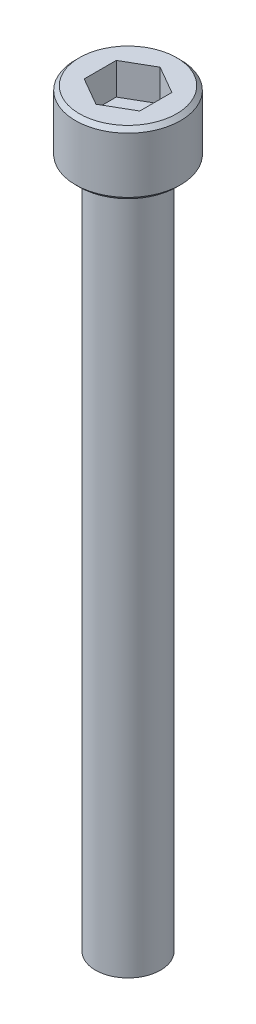
ISO-10303-21;
HEADER;
FILE_DESCRIPTION(('STEP AP214'),'2;1');
FILE_NAME('part.step','',(''),(''),'','','');
FILE_SCHEMA(('AUTOMOTIVE_DESIGN { 1 0 10303 214 1 1 1 1 }'));
ENDSEC;
DATA;
#1=APPLICATION_CONTEXT('core data for automotive mechanical design processes');
#2=APPLICATION_PROTOCOL_DEFINITION('international standard','automotive_design',2000,#1);
#3=PRODUCT_CONTEXT('',#1,'mechanical');
#4=PRODUCT('Part','Part','',(#3));
#5=PRODUCT_RELATED_PRODUCT_CATEGORY('part','',(#4));
#6=PRODUCT_DEFINITION_FORMATION('','',#4);
#7=PRODUCT_DEFINITION_CONTEXT('part definition',#1,'design');
#8=PRODUCT_DEFINITION('design','',#6,#7);
#9=PRODUCT_DEFINITION_SHAPE('','',#8);
#10=(LENGTH_UNIT() NAMED_UNIT(*) SI_UNIT(.MILLI.,.METRE.));
#11=(NAMED_UNIT(*) PLANE_ANGLE_UNIT() SI_UNIT($,.RADIAN.));
#12=(NAMED_UNIT(*) SI_UNIT($,.STERADIAN.) SOLID_ANGLE_UNIT());
#13=UNCERTAINTY_MEASURE_WITH_UNIT(LENGTH_MEASURE(1.E-05),#10,'distance_accuracy_value','');
#14=(GEOMETRIC_REPRESENTATION_CONTEXT(3) GLOBAL_UNCERTAINTY_ASSIGNED_CONTEXT((#13)) GLOBAL_UNIT_ASSIGNED_CONTEXT((#10,
#11,#12)) REPRESENTATION_CONTEXT('',''));
#15=CARTESIAN_POINT('',(0.,0.,0.));
#16=DIRECTION('',(0.,0.,1.));
#17=DIRECTION('',(1.,0.,0.));
#18=AXIS2_PLACEMENT_3D('',#15,#16,#17);
#19=CARTESIAN_POINT('',(1.778,2.032,3.07958633585746));
#20=DIRECTION('',(0.,1.,0.));
#21=DIRECTION('',(-1.,0.,0.));
#22=AXIS2_PLACEMENT_3D('',#19,#20,#21);
#23=PLANE('',#22);
#24=DIRECTION('',(-0.866025403784439,0.,0.5));
#25=VECTOR('',#24,1.);
#26=CARTESIAN_POINT('',(0.,2.032,-2.05305755723831));
#27=LINE('',#26,#25);
#28=CARTESIAN_POINT('',(0.,2.032,-2.05305755723831));
#29=VERTEX_POINT('',#28);
#30=CARTESIAN_POINT('',(-1.778,2.032,-1.02652877861914));
#31=VERTEX_POINT('',#30);
#32=EDGE_CURVE('E68',#29,#31,#27,.T.);
#33=ORIENTED_EDGE('',*,*,#32,.T.);
#34=DIRECTION('',(0.,0.,1.));
#35=VECTOR('',#34,1.);
#36=CARTESIAN_POINT('',(-1.778,2.032,-1.02652877861913));
#37=LINE('',#36,#35);
#38=CARTESIAN_POINT('',(-1.778,2.032,1.02652877861917));
#39=VERTEX_POINT('',#38);
#40=EDGE_CURVE('E70',#31,#39,#37,.T.);
#41=ORIENTED_EDGE('',*,*,#40,.T.);
#42=DIRECTION('',(0.866025403784439,0.,0.499999999999999));
#43=VECTOR('',#42,1.);
#44=CARTESIAN_POINT('',(-1.77799999999999,2.032,1.02652877861917));
#45=LINE('',#44,#43);
#46=CARTESIAN_POINT('',(0.,2.032,2.05305755723832));
#47=VERTEX_POINT('',#46);
#48=EDGE_CURVE('E72',#39,#47,#45,.T.);
#49=ORIENTED_EDGE('',*,*,#48,.T.);
#50=DIRECTION('',(0.866025403784439,0.,-0.5));
#51=VECTOR('',#50,1.);
#52=CARTESIAN_POINT('',(0.,2.032,2.05305755723831));
#53=LINE('',#52,#51);
#54=CARTESIAN_POINT('',(1.77800000000001,2.032,1.02652877861916));
#55=VERTEX_POINT('',#54);
#56=EDGE_CURVE('E127',#47,#55,#53,.T.);
#57=ORIENTED_EDGE('',*,*,#56,.T.);
#58=DIRECTION('',(0.,0.,-1.));
#59=VECTOR('',#58,1.);
#60=CARTESIAN_POINT('',(1.77800000000001,2.032,1.02652877861915));
#61=LINE('',#60,#59);
#62=CARTESIAN_POINT('',(1.77800000000001,2.032,-1.02652877861913));
#63=VERTEX_POINT('',#62);
#64=EDGE_CURVE('E132',#55,#63,#61,.T.);
#65=ORIENTED_EDGE('',*,*,#64,.T.);
#66=DIRECTION('',(-0.866025403784439,0.,-0.499999999999999));
#67=VECTOR('',#66,1.);
#68=CARTESIAN_POINT('',(1.77800000000001,2.032,-1.02652877861913));
#69=LINE('',#68,#67);
#70=EDGE_CURVE('E136',#63,#29,#69,.T.);
#71=ORIENTED_EDGE('',*,*,#70,.T.);
#72=EDGE_LOOP('',(#33,#41,#49,#57,#65,#71));
#73=FACE_BOUND('',#72,.T.);
#74=ADVANCED_FACE('F17',(#73),#23,.T.);
#75=CARTESIAN_POINT('',(-1.77799999999999,2.032,1.02652877861917));
#76=DIRECTION('',(-0.499999999999999,0.,0.866025403784439));
#77=DIRECTION('',(0.866025403784439,0.,0.499999999999999));
#78=AXIS2_PLACEMENT_3D('',#75,#76,#77);
#79=PLANE('',#78);
#80=DIRECTION('',(0.,1.,0.));
#81=VECTOR('',#80,1.);
#82=CARTESIAN_POINT('',(0.,2.032,2.05305755723831));
#83=LINE('',#82,#81);
#84=CARTESIAN_POINT('',(0.,4.064,2.05305755723832));
#85=VERTEX_POINT('',#84);
#86=EDGE_CURVE('E83',#85,#47,#83,.F.);
#87=ORIENTED_EDGE('',*,*,#86,.T.);
#88=ORIENTED_EDGE('',*,*,#48,.F.);
#89=DIRECTION('',(0.,1.,0.));
#90=VECTOR('',#89,1.);
#91=CARTESIAN_POINT('',(-1.778,2.032,1.02652877861917));
#92=LINE('',#91,#90);
#93=CARTESIAN_POINT('',(-1.77799999999999,4.064,1.02652877861917));
#94=VERTEX_POINT('',#93);
#95=EDGE_CURVE('E77',#39,#94,#92,.T.);
#96=ORIENTED_EDGE('',*,*,#95,.T.);
#97=DIRECTION('',(-0.866025403784442,0.,-0.499999999999994));
#98=VECTOR('',#97,1.);
#99=CARTESIAN_POINT('',(0.,4.064,2.05305755723831));
#100=LINE('',#99,#98);
#101=EDGE_CURVE('E124',#85,#94,#100,.T.);
#102=ORIENTED_EDGE('',*,*,#101,.F.);
#103=EDGE_LOOP('',(#87,#88,#96,#102));
#104=FACE_BOUND('',#103,.T.);
#105=ADVANCED_FACE('F80',(#104),#79,.F.);
#106=CARTESIAN_POINT('',(-1.778,2.032,-1.02652877861913));
#107=DIRECTION('',(-1.,0.,0.));
#108=DIRECTION('',(0.,0.,1.));
#109=AXIS2_PLACEMENT_3D('',#106,#107,#108);
#110=PLANE('',#109);
#111=ORIENTED_EDGE('',*,*,#95,.F.);
#112=ORIENTED_EDGE('',*,*,#40,.F.);
#113=DIRECTION('',(0.,1.,0.));
#114=VECTOR('',#113,1.);
#115=CARTESIAN_POINT('',(-1.77800000000001,2.032,-1.02652877861915));
#116=LINE('',#115,#114);
#117=CARTESIAN_POINT('',(-1.778,4.064,-1.02652877861914));
#118=VERTEX_POINT('',#117);
#119=EDGE_CURVE('E91',#31,#118,#116,.T.);
#120=ORIENTED_EDGE('',*,*,#119,.T.);
#121=DIRECTION('',(0.,0.,1.));
#122=VECTOR('',#121,1.);
#123=CARTESIAN_POINT('',(-1.77799999999999,4.064,0.));
#124=LINE('',#123,#122);
#125=EDGE_CURVE('E88',#94,#118,#124,.F.);
#126=ORIENTED_EDGE('',*,*,#125,.F.);
#127=EDGE_LOOP('',(#111,#112,#120,#126));
#128=FACE_BOUND('',#127,.T.);
#129=ADVANCED_FACE('F86',(#128),#110,.F.);
#130=CARTESIAN_POINT('',(0.,2.032,-2.05305755723831));
#131=DIRECTION('',(-0.5,0.,-0.866025403784439));
#132=DIRECTION('',(-0.866025403784439,0.,0.5));
#133=AXIS2_PLACEMENT_3D('',#130,#131,#132);
#134=PLANE('',#133);
#135=ORIENTED_EDGE('',*,*,#119,.F.);
#136=ORIENTED_EDGE('',*,*,#32,.F.);
#137=DIRECTION('',(0.,1.,0.));
#138=VECTOR('',#137,1.);
#139=CARTESIAN_POINT('',(0.,2.032,-2.05305755723829));
#140=LINE('',#139,#138);
#141=CARTESIAN_POINT('',(0.,4.064,-2.05305755723831));
#142=VERTEX_POINT('',#141);
#143=EDGE_CURVE('E134',#29,#142,#140,.T.);
#144=ORIENTED_EDGE('',*,*,#143,.T.);
#145=DIRECTION('',(0.866025403784434,0.,-0.500000000000007));
#146=VECTOR('',#145,1.);
#147=CARTESIAN_POINT('',(-1.778,4.064,-1.02652877861913));
#148=LINE('',#147,#146);
#149=EDGE_CURVE('E120',#118,#142,#148,.T.);
#150=ORIENTED_EDGE('',*,*,#149,.F.);
#151=EDGE_LOOP('',(#135,#136,#144,#150));
#152=FACE_BOUND('',#151,.T.);
#153=ADVANCED_FACE('F139',(#152),#134,.F.);
#154=CARTESIAN_POINT('',(1.77800000000001,2.032,-1.02652877861913));
#155=DIRECTION('',(0.499999999999999,0.,-0.866025403784439));
#156=DIRECTION('',(-0.866025403784439,0.,-0.499999999999999));
#157=AXIS2_PLACEMENT_3D('',#154,#155,#156);
#158=PLANE('',#157);
#159=ORIENTED_EDGE('',*,*,#143,.F.);
#160=ORIENTED_EDGE('',*,*,#70,.F.);
#161=DIRECTION('',(0.,1.,0.));
#162=VECTOR('',#161,1.);
#163=CARTESIAN_POINT('',(1.77800000000001,2.032,-1.02652877861913));
#164=LINE('',#163,#162);
#165=CARTESIAN_POINT('',(1.77800000000001,4.064,-1.02652877861913));
#166=VERTEX_POINT('',#165);
#167=EDGE_CURVE('E130',#63,#166,#164,.T.);
#168=ORIENTED_EDGE('',*,*,#167,.T.);
#169=DIRECTION('',(0.866025403784432,0.,0.500000000000011));
#170=VECTOR('',#169,1.);
#171=CARTESIAN_POINT('',(0.,4.064,-2.05305755723831));
#172=LINE('',#171,#170);
#173=EDGE_CURVE('E117',#142,#166,#172,.T.);
#174=ORIENTED_EDGE('',*,*,#173,.F.);
#175=EDGE_LOOP('',(#159,#160,#168,#174));
#176=FACE_BOUND('',#175,.T.);
#177=ADVANCED_FACE('F151',(#176),#158,.F.);
#178=CARTESIAN_POINT('',(1.77800000000001,2.032,1.02652877861915));
#179=DIRECTION('',(1.,0.,0.));
#180=DIRECTION('',(0.,0.,-1.));
#181=AXIS2_PLACEMENT_3D('',#178,#179,#180);
#182=PLANE('',#181);
#183=ORIENTED_EDGE('',*,*,#167,.F.);
#184=ORIENTED_EDGE('',*,*,#64,.F.);
#185=DIRECTION('',(0.,1.,0.));
#186=VECTOR('',#185,1.);
#187=CARTESIAN_POINT('',(1.77800000000001,2.032,1.02652877861916));
#188=LINE('',#187,#186);
#189=CARTESIAN_POINT('',(1.77800000000001,4.064,1.02652877861916));
#190=VERTEX_POINT('',#189);
#191=EDGE_CURVE('E35',#55,#190,#188,.T.);
#192=ORIENTED_EDGE('',*,*,#191,.T.);
#193=DIRECTION('',(0.,0.,1.));
#194=VECTOR('',#193,1.);
#195=CARTESIAN_POINT('',(1.77800000000001,4.064,0.));
#196=LINE('',#195,#194);
#197=EDGE_CURVE('E114',#166,#190,#196,.T.);
#198=ORIENTED_EDGE('',*,*,#197,.F.);
#199=EDGE_LOOP('',(#183,#184,#192,#198));
#200=FACE_BOUND('',#199,.T.);
#201=ADVANCED_FACE('F149',(#200),#182,.F.);
#202=CARTESIAN_POINT('',(0.,2.032,2.05305755723831));
#203=DIRECTION('',(0.5,0.,0.866025403784439));
#204=DIRECTION('',(0.866025403784439,0.,-0.5));
#205=AXIS2_PLACEMENT_3D('',#202,#203,#204);
#206=PLANE('',#205);
#207=ORIENTED_EDGE('',*,*,#191,.F.);
#208=ORIENTED_EDGE('',*,*,#56,.F.);
#209=ORIENTED_EDGE('',*,*,#86,.F.);
#210=DIRECTION('',(-0.866025403784437,0.,0.500000000000003));
#211=VECTOR('',#210,1.);
#212=CARTESIAN_POINT('',(1.77800000000001,4.064,1.02652877861915));
#213=LINE('',#212,#211);
#214=EDGE_CURVE('E111',#190,#85,#213,.T.);
#215=ORIENTED_EDGE('',*,*,#214,.F.);
#216=EDGE_LOOP('',(#207,#208,#209,#215));
#217=FACE_BOUND('',#216,.T.);
#218=ADVANCED_FACE('F146',(#217),#206,.F.);
#219=CARTESIAN_POINT('',(0.,4.064,0.));
#220=DIRECTION('',(0.,1.,0.));
#221=DIRECTION('',(-1.,0.,0.));
#222=AXIS2_PLACEMENT_3D('',#219,#220,#221);
#223=PLANE('',#222);
#224=ORIENTED_EDGE('',*,*,#197,.T.);
#225=ORIENTED_EDGE('',*,*,#214,.T.);
#226=ORIENTED_EDGE('',*,*,#101,.T.);
#227=ORIENTED_EDGE('',*,*,#125,.T.);
#228=ORIENTED_EDGE('',*,*,#149,.T.);
#229=ORIENTED_EDGE('',*,*,#173,.T.);
#230=EDGE_LOOP('',(#224,#225,#226,#227,#228,#229));
#231=FACE_BOUND('',#230,.T.);
#232=CARTESIAN_POINT('',(0.,4.06400000002805,0.));
#233=DIRECTION('',(0.,-1.,0.));
#234=DIRECTION('',(1.,0.,0.));
#235=AXIS2_PLACEMENT_3D('',#232,#233,#234);
#236=CIRCLE('',#235,3.11149999998861);
#237=CARTESIAN_POINT('',(3.11149999998861,4.06400000002805,0.));
#238=VERTEX_POINT('',#237);
#239=EDGE_CURVE('E20',#238,#238,#236,.T.);
#240=ORIENTED_EDGE('',*,*,#239,.F.);
#241=EDGE_LOOP('',(#240));
#242=FACE_BOUND('',#241,.T.);
#243=ADVANCED_FACE('F143',(#231,#242),#223,.T.);
#244=CARTESIAN_POINT('',(0.,3.81000000004406,0.));
#245=DIRECTION('',(0.,-1.,0.));
#246=DIRECTION('',(1.,0.,0.));
#247=AXIS2_PLACEMENT_3D('',#244,#245,#246);
#248=CONICAL_SURFACE('',#247,3.3654999999726,0.785398163397448);
#249=ORIENTED_EDGE('',*,*,#239,.T.);
#250=EDGE_LOOP('',(#249));
#251=FACE_BOUND('',#250,.T.);
#252=CARTESIAN_POINT('',(0.,3.81000000000001,0.));
#253=DIRECTION('',(0.,-1.,0.));
#254=DIRECTION('',(1.,0.,0.));
#255=AXIS2_PLACEMENT_3D('',#252,#253,#254);
#256=CIRCLE('',#255,3.3655);
#257=CARTESIAN_POINT('',(3.3655,3.81000000000001,0.));
#258=VERTEX_POINT('',#257);
#259=EDGE_CURVE('E103',#258,#258,#256,.T.);
#260=ORIENTED_EDGE('',*,*,#259,.F.);
#261=EDGE_LOOP('',(#260));
#262=FACE_BOUND('',#261,.T.);
#263=ADVANCED_FACE('F188',(#251,#262),#248,.T.);
#264=CARTESIAN_POINT('',(0.,4.064,0.));
#265=DIRECTION('',(0.,-1.,0.));
#266=DIRECTION('',(1.,0.,0.));
#267=AXIS2_PLACEMENT_3D('',#264,#265,#266);
#268=CYLINDRICAL_SURFACE('',#267,3.3655);
#269=ORIENTED_EDGE('',*,*,#259,.T.);
#270=EDGE_LOOP('',(#269));
#271=FACE_BOUND('',#270,.T.);
#272=CARTESIAN_POINT('',(0.,0.254000000097676,0.));
#273=DIRECTION('',(0.,1.,0.));
#274=DIRECTION('',(0.,0.,1.));
#275=AXIS2_PLACEMENT_3D('',#272,#273,#274);
#276=CIRCLE('',#275,3.36550000008629);
#277=CARTESIAN_POINT('',(0.,0.254000000097676,3.36550000008629));
#278=VERTEX_POINT('',#277);
#279=EDGE_CURVE('E99',#278,#278,#276,.F.);
#280=ORIENTED_EDGE('',*,*,#279,.F.);
#281=EDGE_LOOP('',(#280));
#282=FACE_BOUND('',#281,.T.);
#283=ADVANCED_FACE('F184',(#271,#282),#268,.T.);
#284=CARTESIAN_POINT('',(0.,-44.45,0.));
#285=DIRECTION('',(0.,1.,0.));
#286=DIRECTION('',(-1.,0.,0.));
#287=AXIS2_PLACEMENT_3D('',#284,#285,#286);
#288=PLANE('',#287);
#289=CARTESIAN_POINT('',(0.,-44.4499999999834,0.));
#290=DIRECTION('',(0.,1.,0.));
#291=DIRECTION('',(0.,0.,1.));
#292=AXIS2_PLACEMENT_3D('',#289,#290,#291);
#293=CIRCLE('',#292,1.31318000001102);
#294=CARTESIAN_POINT('',(0.,-44.4499999999834,1.31318000001102));
#295=VERTEX_POINT('',#294);
#296=EDGE_CURVE('E97',#295,#295,#293,.T.);
#297=ORIENTED_EDGE('',*,*,#296,.F.);
#298=EDGE_LOOP('',(#297));
#299=FACE_BOUND('',#298,.T.);
#300=ADVANCED_FACE('F180',(#299),#288,.F.);
#301=CARTESIAN_POINT('',(0.,0.253999999927146,0.));
#302=DIRECTION('',(0.,1.,0.));
#303=DIRECTION('',(0.,0.,1.));
#304=AXIS2_PLACEMENT_3D('',#301,#302,#303);
#305=CONICAL_SURFACE('',#304,3.36549999991576,0.785398163397448);
#306=CARTESIAN_POINT('',(0.,0.,0.));
#307=DIRECTION('',(0.,1.,0.));
#308=DIRECTION('',(0.,0.,1.));
#309=AXIS2_PLACEMENT_3D('',#306,#307,#308);
#310=CIRCLE('',#309,3.11149999998861);
#311=CARTESIAN_POINT('',(0.,0.,3.11149999998861));
#312=VERTEX_POINT('',#311);
#313=EDGE_CURVE('E95',#312,#312,#310,.T.);
#314=ORIENTED_EDGE('',*,*,#313,.T.);
#315=EDGE_LOOP('',(#314));
#316=FACE_BOUND('',#315,.T.);
#317=ORIENTED_EDGE('',*,*,#279,.T.);
#318=EDGE_LOOP('',(#317));
#319=FACE_BOUND('',#318,.T.);
#320=ADVANCED_FACE('F176',(#316,#319),#305,.T.);
#321=CARTESIAN_POINT('',(0.,-43.9115199999947,0.));
#322=DIRECTION('',(0.,1.,0.));
#323=DIRECTION('',(0.,0.,1.));
#324=AXIS2_PLACEMENT_3D('',#321,#322,#323);
#325=CONICAL_SURFACE('',#324,2.0827999999824,0.960291895402791);
#326=CARTESIAN_POINT('',(0.,-43.91152,0.));
#327=DIRECTION('',(0.,1.,0.));
#328=DIRECTION('',(-1.,0.,0.));
#329=AXIS2_PLACEMENT_3D('',#326,#327,#328);
#330=CIRCLE('',#329,2.0828);
#331=CARTESIAN_POINT('',(-2.0828,-43.91152,0.));
#332=VERTEX_POINT('',#331);
#333=EDGE_CURVE('E26',#332,#332,#330,.T.);
#334=ORIENTED_EDGE('',*,*,#333,.F.);
#335=EDGE_LOOP('',(#334));
#336=FACE_BOUND('',#335,.T.);
#337=ORIENTED_EDGE('',*,*,#296,.T.);
#338=EDGE_LOOP('',(#337));
#339=FACE_BOUND('',#338,.T.);
#340=ADVANCED_FACE('F169',(#336,#339),#325,.T.);
#341=CARTESIAN_POINT('',(0.,0.,0.));
#342=DIRECTION('',(0.,1.,0.));
#343=DIRECTION('',(-1.,0.,0.));
#344=AXIS2_PLACEMENT_3D('',#341,#342,#343);
#345=PLANE('',#344);
#346=CARTESIAN_POINT('',(0.,0.,0.));
#347=DIRECTION('',(0.,1.,0.));
#348=DIRECTION('',(-1.,0.,0.));
#349=AXIS2_PLACEMENT_3D('',#346,#347,#348);
#350=CIRCLE('',#349,2.0828);
#351=CARTESIAN_POINT('',(-2.0828,0.,0.));
#352=VERTEX_POINT('',#351);
#353=EDGE_CURVE('E11',#352,#352,#350,.F.);
#354=ORIENTED_EDGE('',*,*,#353,.F.);
#355=EDGE_LOOP('',(#354));
#356=FACE_BOUND('',#355,.T.);
#357=ORIENTED_EDGE('',*,*,#313,.F.);
#358=EDGE_LOOP('',(#357));
#359=FACE_BOUND('',#358,.T.);
#360=ADVANCED_FACE('F163',(#356,#359),#345,.F.);
#361=CARTESIAN_POINT('',(0.,-44.45,0.));
#362=DIRECTION('',(0.,1.,0.));
#363=DIRECTION('',(-1.,0.,0.));
#364=AXIS2_PLACEMENT_3D('',#361,#362,#363);
#365=CYLINDRICAL_SURFACE('',#364,2.0828);
#366=ORIENTED_EDGE('',*,*,#353,.T.);
#367=EDGE_LOOP('',(#366));
#368=FACE_BOUND('',#367,.T.);
#369=ORIENTED_EDGE('',*,*,#333,.T.);
#370=EDGE_LOOP('',(#369));
#371=FACE_BOUND('',#370,.T.);
#372=ADVANCED_FACE('F161',(#368,#371),#365,.T.);
#373=CLOSED_SHELL('',(#74,#105,#129,#153,#177,#201,#218,#243,#263,#283,#300,#320,#340,#360,#372));
#374=MANIFOLD_SOLID_BREP('B1',#373);
#375=ADVANCED_BREP_SHAPE_REPRESENTATION('',(#18,#374),#14);
#376=SHAPE_DEFINITION_REPRESENTATION(#9,#375);
ENDSEC;
END-ISO-10303-21;
